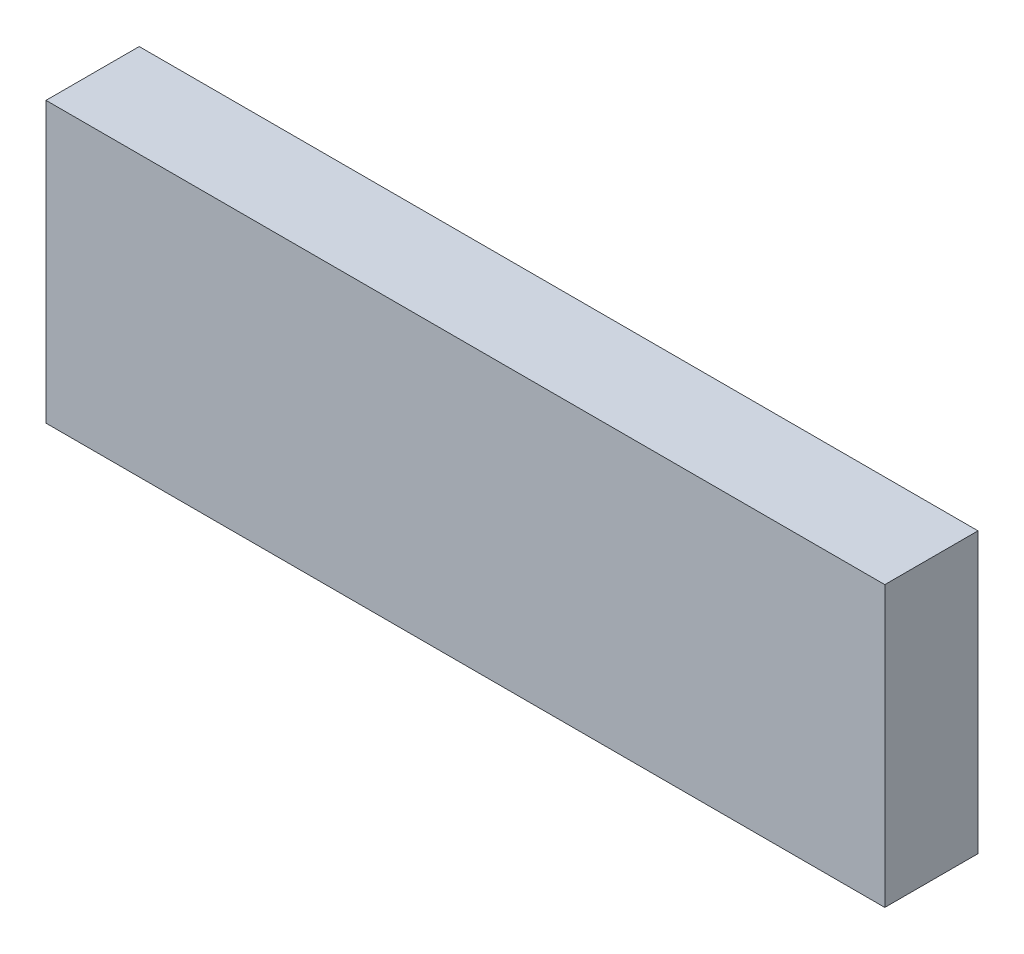
ISO-10303-21;
HEADER;
FILE_DESCRIPTION(('STEP AP214'),'2;1');
FILE_NAME('part.step','',(''),(''),'','','');
FILE_SCHEMA(('AUTOMOTIVE_DESIGN { 1 0 10303 214 1 1 1 1 }'));
ENDSEC;
DATA;
#1=APPLICATION_CONTEXT('core data for automotive mechanical design processes');
#2=APPLICATION_PROTOCOL_DEFINITION('international standard','automotive_design',2000,#1);
#3=PRODUCT_CONTEXT('',#1,'mechanical');
#4=PRODUCT('Part','Part','',(#3));
#5=PRODUCT_RELATED_PRODUCT_CATEGORY('part','',(#4));
#6=PRODUCT_DEFINITION_FORMATION('','',#4);
#7=PRODUCT_DEFINITION_CONTEXT('part definition',#1,'design');
#8=PRODUCT_DEFINITION('design','',#6,#7);
#9=PRODUCT_DEFINITION_SHAPE('','',#8);
#10=(LENGTH_UNIT() NAMED_UNIT(*) SI_UNIT(.MILLI.,.METRE.));
#11=(NAMED_UNIT(*) PLANE_ANGLE_UNIT() SI_UNIT($,.RADIAN.));
#12=(NAMED_UNIT(*) SI_UNIT($,.STERADIAN.) SOLID_ANGLE_UNIT());
#13=UNCERTAINTY_MEASURE_WITH_UNIT(LENGTH_MEASURE(1.E-05),#10,'distance_accuracy_value','');
#14=(GEOMETRIC_REPRESENTATION_CONTEXT(3) GLOBAL_UNCERTAINTY_ASSIGNED_CONTEXT((#13)) GLOBAL_UNIT_ASSIGNED_CONTEXT((#10,
#11,#12)) REPRESENTATION_CONTEXT('',''));
#15=CARTESIAN_POINT('',(0.,0.,0.));
#16=DIRECTION('',(0.,0.,1.));
#17=DIRECTION('',(1.,0.,0.));
#18=AXIS2_PLACEMENT_3D('',#15,#16,#17);
#19=CARTESIAN_POINT('',(90.,-30.,20.));
#20=DIRECTION('',(-1.,0.,0.));
#21=DIRECTION('',(0.,0.,1.));
#22=AXIS2_PLACEMENT_3D('',#19,#20,#21);
#23=PLANE('',#22);
#24=DIRECTION('',(0.,1.,0.));
#25=VECTOR('',#24,1.);
#26=CARTESIAN_POINT('',(90.,-30.,0.));
#27=LINE('',#26,#25);
#28=CARTESIAN_POINT('',(90.,-30.,0.));
#29=VERTEX_POINT('',#28);
#30=CARTESIAN_POINT('',(90.,30.,0.));
#31=VERTEX_POINT('',#30);
#32=EDGE_CURVE('E96',#29,#31,#27,.T.);
#33=ORIENTED_EDGE('',*,*,#32,.T.);
#34=DIRECTION('',(0.,0.,-1.));
#35=VECTOR('',#34,1.);
#36=CARTESIAN_POINT('',(90.,30.,20.));
#37=LINE('',#36,#35);
#38=CARTESIAN_POINT('',(90.,30.,20.));
#39=VERTEX_POINT('',#38);
#40=EDGE_CURVE('E11',#39,#31,#37,.T.);
#41=ORIENTED_EDGE('',*,*,#40,.F.);
#42=DIRECTION('',(0.,1.,0.));
#43=VECTOR('',#42,1.);
#44=CARTESIAN_POINT('',(90.,-30.,20.));
#45=LINE('',#44,#43);
#46=CARTESIAN_POINT('',(90.,-30.,20.));
#47=VERTEX_POINT('',#46);
#48=EDGE_CURVE('E84',#47,#39,#45,.T.);
#49=ORIENTED_EDGE('',*,*,#48,.F.);
#50=DIRECTION('',(0.,0.,-1.));
#51=VECTOR('',#50,1.);
#52=CARTESIAN_POINT('',(90.,-30.,20.));
#53=LINE('',#52,#51);
#54=EDGE_CURVE('E92',#47,#29,#53,.T.);
#55=ORIENTED_EDGE('',*,*,#54,.T.);
#56=EDGE_LOOP('',(#33,#41,#49,#55));
#57=FACE_BOUND('',#56,.T.);
#58=ADVANCED_FACE('F33',(#57),#23,.F.);
#59=CARTESIAN_POINT('',(-90.,30.,20.));
#60=DIRECTION('',(0.,-1.,0.));
#61=DIRECTION('',(0.,0.,-1.));
#62=AXIS2_PLACEMENT_3D('',#59,#60,#61);
#63=PLANE('',#62);
#64=DIRECTION('',(-1.,0.,0.));
#65=VECTOR('',#64,1.);
#66=CARTESIAN_POINT('',(-90.,30.,0.));
#67=LINE('',#66,#65);
#68=CARTESIAN_POINT('',(-90.,30.,0.));
#69=VERTEX_POINT('',#68);
#70=EDGE_CURVE('E88',#31,#69,#67,.T.);
#71=ORIENTED_EDGE('',*,*,#70,.T.);
#72=DIRECTION('',(0.,0.,-1.));
#73=VECTOR('',#72,1.);
#74=CARTESIAN_POINT('',(-90.,30.,20.));
#75=LINE('',#74,#73);
#76=CARTESIAN_POINT('',(-90.,30.,20.));
#77=VERTEX_POINT('',#76);
#78=EDGE_CURVE('E41',#77,#69,#75,.T.);
#79=ORIENTED_EDGE('',*,*,#78,.F.);
#80=DIRECTION('',(-1.,0.,0.));
#81=VECTOR('',#80,1.);
#82=CARTESIAN_POINT('',(-90.,30.,20.));
#83=LINE('',#82,#81);
#84=EDGE_CURVE('E79',#39,#77,#83,.T.);
#85=ORIENTED_EDGE('',*,*,#84,.F.);
#86=ORIENTED_EDGE('',*,*,#40,.T.);
#87=EDGE_LOOP('',(#71,#79,#85,#86));
#88=FACE_BOUND('',#87,.T.);
#89=ADVANCED_FACE('F87',(#88),#63,.F.);
#90=CARTESIAN_POINT('',(-90.,-30.,20.));
#91=DIRECTION('',(1.,0.,0.));
#92=DIRECTION('',(0.,0.,-1.));
#93=AXIS2_PLACEMENT_3D('',#90,#91,#92);
#94=PLANE('',#93);
#95=DIRECTION('',(0.,-1.,0.));
#96=VECTOR('',#95,1.);
#97=CARTESIAN_POINT('',(-90.,-30.,0.));
#98=LINE('',#97,#96);
#99=CARTESIAN_POINT('',(-90.,-30.,0.));
#100=VERTEX_POINT('',#99);
#101=EDGE_CURVE('E66',#69,#100,#98,.T.);
#102=ORIENTED_EDGE('',*,*,#101,.T.);
#103=DIRECTION('',(0.,0.,-1.));
#104=VECTOR('',#103,1.);
#105=CARTESIAN_POINT('',(-90.,-30.,20.));
#106=LINE('',#105,#104);
#107=CARTESIAN_POINT('',(-90.,-30.,20.));
#108=VERTEX_POINT('',#107);
#109=EDGE_CURVE('E89',#108,#100,#106,.T.);
#110=ORIENTED_EDGE('',*,*,#109,.F.);
#111=DIRECTION('',(0.,-1.,0.));
#112=VECTOR('',#111,1.);
#113=CARTESIAN_POINT('',(-90.,-30.,20.));
#114=LINE('',#113,#112);
#115=EDGE_CURVE('E82',#77,#108,#114,.T.);
#116=ORIENTED_EDGE('',*,*,#115,.F.);
#117=ORIENTED_EDGE('',*,*,#78,.T.);
#118=EDGE_LOOP('',(#102,#110,#116,#117));
#119=FACE_BOUND('',#118,.T.);
#120=ADVANCED_FACE('F90',(#119),#94,.F.);
#121=CARTESIAN_POINT('',(-90.,-30.,20.));
#122=DIRECTION('',(0.,1.,0.));
#123=DIRECTION('',(0.,0.,1.));
#124=AXIS2_PLACEMENT_3D('',#121,#122,#123);
#125=PLANE('',#124);
#126=DIRECTION('',(1.,0.,0.));
#127=VECTOR('',#126,1.);
#128=CARTESIAN_POINT('',(-90.,-30.,0.));
#129=LINE('',#128,#127);
#130=EDGE_CURVE('E72',#100,#29,#129,.T.);
#131=ORIENTED_EDGE('',*,*,#130,.T.);
#132=ORIENTED_EDGE('',*,*,#54,.F.);
#133=DIRECTION('',(1.,0.,0.));
#134=VECTOR('',#133,1.);
#135=CARTESIAN_POINT('',(-90.,-30.,20.));
#136=LINE('',#135,#134);
#137=EDGE_CURVE('E49',#108,#47,#136,.T.);
#138=ORIENTED_EDGE('',*,*,#137,.F.);
#139=ORIENTED_EDGE('',*,*,#109,.T.);
#140=EDGE_LOOP('',(#131,#132,#138,#139));
#141=FACE_BOUND('',#140,.T.);
#142=ADVANCED_FACE('F103',(#141),#125,.F.);
#143=CARTESIAN_POINT('',(89.9999999999999,30.,20.));
#144=DIRECTION('',(0.,0.,-1.));
#145=DIRECTION('',(-1.,0.,0.));
#146=AXIS2_PLACEMENT_3D('',#143,#144,#145);
#147=PLANE('',#146);
#148=ORIENTED_EDGE('',*,*,#48,.T.);
#149=ORIENTED_EDGE('',*,*,#84,.T.);
#150=ORIENTED_EDGE('',*,*,#115,.T.);
#151=ORIENTED_EDGE('',*,*,#137,.T.);
#152=EDGE_LOOP('',(#148,#149,#150,#151));
#153=FACE_BOUND('',#152,.T.);
#154=ADVANCED_FACE('F80',(#153),#147,.F.);
#155=CARTESIAN_POINT('',(89.9999999999999,30.,0.));
#156=DIRECTION('',(0.,0.,-1.));
#157=DIRECTION('',(-1.,0.,0.));
#158=AXIS2_PLACEMENT_3D('',#155,#156,#157);
#159=PLANE('',#158);
#160=ORIENTED_EDGE('',*,*,#32,.F.);
#161=ORIENTED_EDGE('',*,*,#130,.F.);
#162=ORIENTED_EDGE('',*,*,#101,.F.);
#163=ORIENTED_EDGE('',*,*,#70,.F.);
#164=EDGE_LOOP('',(#160,#161,#162,#163));
#165=FACE_BOUND('',#164,.T.);
#166=ADVANCED_FACE('F106',(#165),#159,.T.);
#167=CLOSED_SHELL('',(#58,#89,#120,#142,#154,#166));
#168=MANIFOLD_SOLID_BREP('B2',#167);
#169=ADVANCED_BREP_SHAPE_REPRESENTATION('',(#18,#168),#14);
#170=SHAPE_DEFINITION_REPRESENTATION(#9,#169);
ENDSEC;
END-ISO-10303-21;
